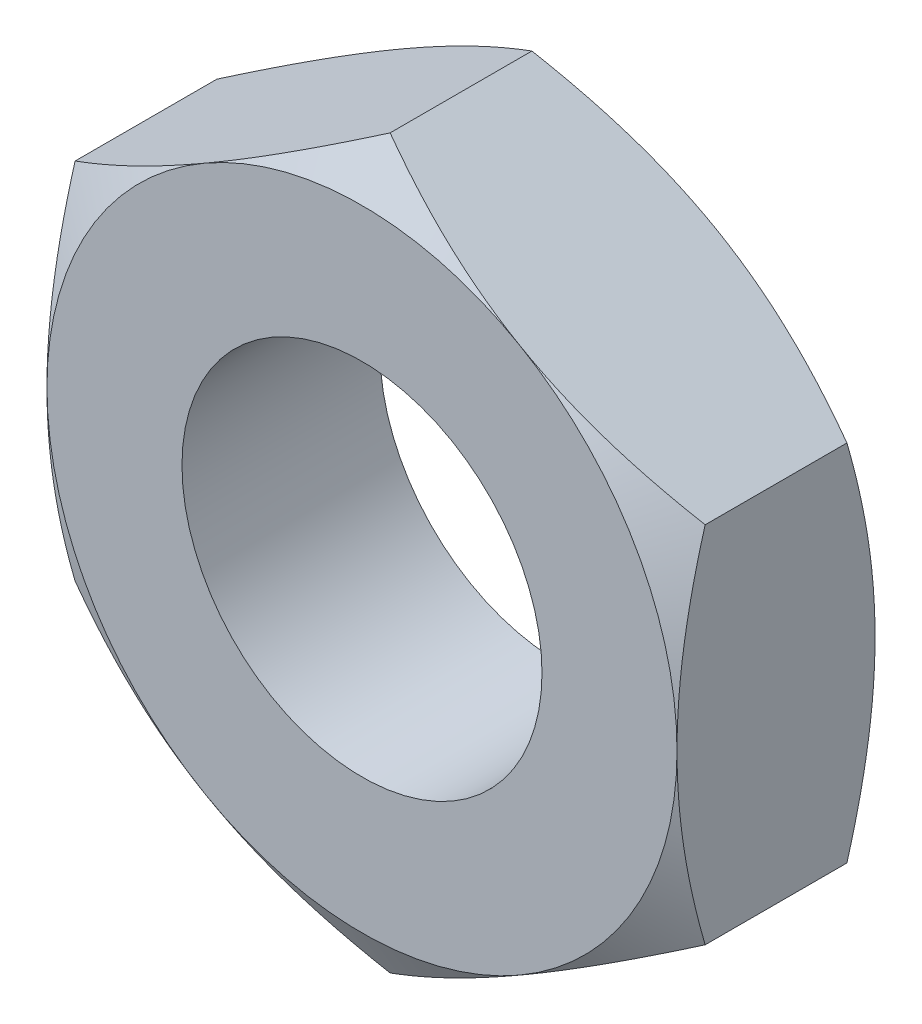
ISO-10303-21;
HEADER;
FILE_DESCRIPTION(('STEP AP214'),'2;1');
FILE_NAME('part.step','',(''),(''),'','','');
FILE_SCHEMA(('AUTOMOTIVE_DESIGN { 1 0 10303 214 1 1 1 1 }'));
ENDSEC;
DATA;
#1=APPLICATION_CONTEXT('core data for automotive mechanical design processes');
#2=APPLICATION_PROTOCOL_DEFINITION('international standard','automotive_design',2000,#1);
#3=PRODUCT_CONTEXT('',#1,'mechanical');
#4=PRODUCT('Part','Part','',(#3));
#5=PRODUCT_RELATED_PRODUCT_CATEGORY('part','',(#4));
#6=PRODUCT_DEFINITION_FORMATION('','',#4);
#7=PRODUCT_DEFINITION_CONTEXT('part definition',#1,'design');
#8=PRODUCT_DEFINITION('design','',#6,#7);
#9=PRODUCT_DEFINITION_SHAPE('','',#8);
#10=(LENGTH_UNIT() NAMED_UNIT(*) SI_UNIT(.MILLI.,.METRE.));
#11=(NAMED_UNIT(*) PLANE_ANGLE_UNIT() SI_UNIT($,.RADIAN.));
#12=(NAMED_UNIT(*) SI_UNIT($,.STERADIAN.) SOLID_ANGLE_UNIT());
#13=UNCERTAINTY_MEASURE_WITH_UNIT(LENGTH_MEASURE(1.E-05),#10,'distance_accuracy_value','');
#14=(GEOMETRIC_REPRESENTATION_CONTEXT(3) GLOBAL_UNCERTAINTY_ASSIGNED_CONTEXT((#13)) GLOBAL_UNIT_ASSIGNED_CONTEXT((#10,
#11,#12)) REPRESENTATION_CONTEXT('',''));
#15=CARTESIAN_POINT('',(0.,0.,0.));
#16=DIRECTION('',(0.,0.,1.));
#17=DIRECTION('',(1.,0.,0.));
#18=AXIS2_PLACEMENT_3D('',#15,#16,#17);
#19=CARTESIAN_POINT('',(3.5,-2.02072594216369,2.2));
#20=DIRECTION('',(-1.,0.,0.));
#21=DIRECTION('',(0.,-1.,0.));
#22=AXIS2_PLACEMENT_3D('',#19,#20,#21);
#23=PLANE('',#22);
#24=CARTESIAN_POINT('',(3.5,-5.46924830003466,1.72817064960977));
#25=CARTESIAN_POINT('',(3.5,-5.3160325339319,1.65368203284161));
#26=CARTESIAN_POINT('',(3.5,-5.16246946761777,1.57989576354144));
#27=CARTESIAN_POINT('',(3.5,-4.85446420827163,1.43412210319563));
#28=CARTESIAN_POINT('',(3.5,-4.70002188497813,1.36213498768279));
#29=CARTESIAN_POINT('',(3.5,-4.38929746018345,1.22000042777458));
#30=CARTESIAN_POINT('',(3.5,-4.23300994428253,1.14986477981532));
#31=CARTESIAN_POINT('',(3.5,-3.91920628647874,1.01240881530144));
#32=CARTESIAN_POINT('',(3.5,-3.76169020182315,0.945088368486654));
#33=CARTESIAN_POINT('',(3.5,-3.43992986743568,0.811830717092529));
#34=CARTESIAN_POINT('',(3.5,-3.27563570301545,0.746013387877366));
#35=CARTESIAN_POINT('',(3.5,-2.94514050214117,0.619260680803184));
#36=CARTESIAN_POINT('',(3.5,-2.7789392562696,0.55832584507309));
#37=CARTESIAN_POINT('',(3.5,-2.44466350046549,0.442907590019832));
#38=CARTESIAN_POINT('',(3.5,-2.2765934237126,0.388411458204929));
#39=CARTESIAN_POINT('',(3.5,-1.93804244355421,0.287592026768664));
#40=CARTESIAN_POINT('',(3.5,-1.76756230447281,0.241266196164791));
#41=CARTESIAN_POINT('',(3.5,-1.42505372862918,0.159233291877059));
#42=CARTESIAN_POINT('',(3.5,-1.25303977115115,0.123466864404243));
#43=CARTESIAN_POINT('',(3.5,-0.906829690133214,0.0645428429456271));
#44=CARTESIAN_POINT('',(3.5,-0.732633786424573,0.0413839890338932));
#45=CARTESIAN_POINT('',(3.5,-0.385221930339845,0.00982402416555703));
#46=CARTESIAN_POINT('',(3.5,-0.212023945606533,0.00123000796357498));
#47=CARTESIAN_POINT('',(3.5,0.134483135220442,-0.000982061038494));
#48=CARTESIAN_POINT('',(3.5,0.30779223262792,0.00540006663312595));
#49=CARTESIAN_POINT('',(3.5,0.600808452449651,0.0283953341508482));
#50=CARTESIAN_POINT('',(3.5,0.720823864600969,0.0413165782556901));
#51=CARTESIAN_POINT('',(3.5,0.959997786268783,0.0735584985751194));
#52=CARTESIAN_POINT('',(3.5,1.07915618177377,0.0928800107168157));
#53=CARTESIAN_POINT('',(3.5,1.43517556933922,0.159431749380929));
#54=CARTESIAN_POINT('',(3.5,1.67045252291874,0.215237755366697));
#55=CARTESIAN_POINT('',(3.5,2.0223028186702,0.312280798498559));
#56=CARTESIAN_POINT('',(3.5,2.14069288058519,0.347308563183211));
#57=CARTESIAN_POINT('',(3.5,2.37632363129615,0.421071086909466));
#58=CARTESIAN_POINT('',(3.5,2.49356431231599,0.459805871011859));
#59=CARTESIAN_POINT('',(3.5,2.72693202144766,0.540355146382419));
#60=CARTESIAN_POINT('',(3.5,2.84305938630442,0.582168670929318));
#61=CARTESIAN_POINT('',(3.5,3.07434746444732,0.668376668121523));
#62=CARTESIAN_POINT('',(3.5,3.189508190491,0.712771106642873));
#63=CARTESIAN_POINT('',(3.5,3.46665383346563,0.822612348916457));
#64=CARTESIAN_POINT('',(3.5,3.62820926065219,0.889140988213676));
#65=CARTESIAN_POINT('',(3.5,3.94989428806168,1.0255706968675));
#66=CARTESIAN_POINT('',(3.5,4.11002378958713,1.09547199755118));
#67=CARTESIAN_POINT('',(3.5,4.42912766847981,1.23795147957417));
#68=CARTESIAN_POINT('',(3.5,4.58810177576508,1.31053026413931));
#69=CARTESIAN_POINT('',(3.5,4.90506153613176,1.45781837889872));
#70=CARTESIAN_POINT('',(3.5,5.06304716611059,1.5325277586639));
#71=CARTESIAN_POINT('',(3.5,5.53614087361735,1.75938858364162));
#72=CARTESIAN_POINT('',(3.5,5.85001764077631,1.91410589374331));
#73=CARTESIAN_POINT('',(3.5,6.47541755316769,2.22809162540922));
#74=CARTESIAN_POINT('',(3.5,6.78694100917245,2.38735943227612));
#75=CARTESIAN_POINT('',(3.5,7.38120615790457,2.69508119469331));
#76=CARTESIAN_POINT('',(3.5,7.66408741921195,2.84326612407885));
#77=CARTESIAN_POINT('',(3.5,8.22880069564564,3.14164545053329));
#78=CARTESIAN_POINT('',(3.5,8.51063266881926,3.29183992686819));
#79=CARTESIAN_POINT('',(3.5,9.07272628611477,3.59335012868182));
#80=CARTESIAN_POINT('',(3.5,9.3529901139039,3.74466178850475));
#81=CARTESIAN_POINT('',(3.5,9.912849860214,4.0484767281834));
#82=CARTESIAN_POINT('',(3.5,10.1924458174643,4.20097993663836));
#83=CARTESIAN_POINT('',(3.5,10.4717977315042,4.35392562294259));
#84=B_SPLINE_CURVE_WITH_KNOTS('',3,(#24,#25,#26,#27,#28,#29,#30,#31,#32,#33,#34,#35,#36,#37,#38,
#39,#40,#41,#42,#43,#44,#45,#46,#47,#48,#49,#50,#51,#52,#53,#54,#55,#56,#57,#58,#59,#60,#61,#62,
#63,#64,#65,#66,#67,#68,#69,#70,#71,#72,#73,#74,#75,#76,#77,#78,#79,#80,#81,#82,#83),
.UNSPECIFIED.,.F.,.F.,(4,2,2,2,2,2,2,2,2,2,2,2,2,2,2,2,2,2,2,2,2,2,2,2,2,2,2,2,2,4),(0.,
0.511095691915975,1.02226918221845,1.53615661638066,2.05002024645588,2.58092205299665,
3.11188272690305,3.64177691176673,4.17150665745021,4.69819951186406,5.22483972205929,
5.74444865949466,6.26406385856815,6.626015949001,6.98801533197522,7.71239857979882,
8.08275565698911,8.45311523810376,8.82335901859984,9.19359790497297,9.71769804639403,
10.2418341865024,10.7660891422144,11.2903563053274,12.3401028193587,13.3897081941522,
14.3477294074532,15.3057885216882,16.2612890207642,17.2167326962569),.UNSPECIFIED.);
#85=CARTESIAN_POINT('',(3.5,2.02072594216369,0.312607391169643));
#86=VERTEX_POINT('',#85);
#87=CARTESIAN_POINT('',(3.5,0.,0.));
#88=VERTEX_POINT('',#87);
#89=EDGE_CURVE('E123',#86,#88,#84,.F.);
#90=ORIENTED_EDGE('',*,*,#89,.F.);
#91=DIRECTION('',(0.,0.,-1.));
#92=VECTOR('',#91,1.);
#93=CARTESIAN_POINT('',(3.5,2.02072594216369,2.2));
#94=LINE('',#93,#92);
#95=CARTESIAN_POINT('',(3.5,2.02072594216369,1.88739260883036));
#96=VERTEX_POINT('',#95);
#97=EDGE_CURVE('E258',#96,#86,#94,.T.);
#98=ORIENTED_EDGE('',*,*,#97,.F.);
#99=CARTESIAN_POINT('',(3.5,-5.46924830003466,0.47182935039024));
#100=CARTESIAN_POINT('',(3.5,-5.3160325339319,0.546317967158399));
#101=CARTESIAN_POINT('',(3.5,-5.16246946761776,0.620104236458562));
#102=CARTESIAN_POINT('',(3.5,-4.85446420827163,0.765877896804374));
#103=CARTESIAN_POINT('',(3.5,-4.70002188497813,0.837865012317215));
#104=CARTESIAN_POINT('',(3.5,-4.38929746018345,0.979999572225422));
#105=CARTESIAN_POINT('',(3.5,-4.23300994428253,1.05013522018468));
#106=CARTESIAN_POINT('',(3.5,-3.91920628647874,1.18759118469857));
#107=CARTESIAN_POINT('',(3.5,-3.76169020182314,1.25491163151335));
#108=CARTESIAN_POINT('',(3.5,-3.43992986743568,1.38816928290748));
#109=CARTESIAN_POINT('',(3.5,-3.27563570301545,1.45398661212264));
#110=CARTESIAN_POINT('',(3.5,-2.94514050214116,1.58073931919682));
#111=CARTESIAN_POINT('',(3.5,-2.7789392562696,1.64167415492691));
#112=CARTESIAN_POINT('',(3.5,-2.44466350046549,1.75709240998017));
#113=CARTESIAN_POINT('',(3.5,-2.2765934237126,1.81158854179507));
#114=CARTESIAN_POINT('',(3.5,-1.93804244355421,1.91240797323134));
#115=CARTESIAN_POINT('',(3.5,-1.7675623044728,1.95873380383521));
#116=CARTESIAN_POINT('',(3.5,-1.42505372862918,2.04076670812294));
#117=CARTESIAN_POINT('',(3.5,-1.25303977115115,2.07653313559576));
#118=CARTESIAN_POINT('',(3.5,-0.906829690133215,2.13545715705437));
#119=CARTESIAN_POINT('',(3.5,-0.732633786424574,2.15861601096611));
#120=CARTESIAN_POINT('',(3.5,-0.385221930339846,2.19017597583444));
#121=CARTESIAN_POINT('',(3.5,-0.212023945606534,2.19876999203643));
#122=CARTESIAN_POINT('',(3.5,0.134483135220441,2.20098206103849));
#123=CARTESIAN_POINT('',(3.5,0.307792232627919,2.19459993336688));
#124=CARTESIAN_POINT('',(3.5,0.600808452449651,2.17160466584915));
#125=CARTESIAN_POINT('',(3.5,0.720823864600968,2.15868342174431));
#126=CARTESIAN_POINT('',(3.5,0.959997786268783,2.12644150142488));
#127=CARTESIAN_POINT('',(3.5,1.07915618177377,2.10711998928319));
#128=CARTESIAN_POINT('',(3.5,1.43517556933922,2.04056825061907));
#129=CARTESIAN_POINT('',(3.5,1.67045252291874,1.9847622446333));
#130=CARTESIAN_POINT('',(3.5,2.02230281867021,1.88771920150144));
#131=CARTESIAN_POINT('',(3.5,2.1406928805852,1.85269143681679));
#132=CARTESIAN_POINT('',(3.5,2.37632363129616,1.77892891309053));
#133=CARTESIAN_POINT('',(3.5,2.49356431231599,1.74019412898814));
#134=CARTESIAN_POINT('',(3.5,2.72693202144767,1.65964485361758));
#135=CARTESIAN_POINT('',(3.5,2.84305938630443,1.61783132907068));
#136=CARTESIAN_POINT('',(3.5,3.07434746444733,1.53162333187848));
#137=CARTESIAN_POINT('',(3.5,3.18950819049101,1.48722889335713));
#138=CARTESIAN_POINT('',(3.5,3.46665383346564,1.37738765108354));
#139=CARTESIAN_POINT('',(3.5,3.6282092606522,1.31085901178632));
#140=CARTESIAN_POINT('',(3.5,3.94989428806169,1.1744293031325));
#141=CARTESIAN_POINT('',(3.5,4.11002378958714,1.10452800244882));
#142=CARTESIAN_POINT('',(3.5,4.42912766847982,0.962048520425834));
#143=CARTESIAN_POINT('',(3.5,4.58810177576509,0.889469735860695));
#144=CARTESIAN_POINT('',(3.5,4.90506153613177,0.74218162110128));
#145=CARTESIAN_POINT('',(3.5,5.0630471661106,0.667472241336096));
#146=CARTESIAN_POINT('',(3.5,5.53614087361736,0.440611416358378));
#147=CARTESIAN_POINT('',(3.5,5.85001764077632,0.285894106256687));
#148=CARTESIAN_POINT('',(3.5,6.47541755316769,-0.0280916254092149));
#149=CARTESIAN_POINT('',(3.5,6.78694100917246,-0.187359432276113));
#150=CARTESIAN_POINT('',(3.5,7.38120615790458,-0.495081194693306));
#151=CARTESIAN_POINT('',(3.5,7.66408741921196,-0.643266124078848));
#152=CARTESIAN_POINT('',(3.5,8.22880069564565,-0.941645450533288));
#153=CARTESIAN_POINT('',(3.5,8.51063266881927,-1.09183992686819));
#154=CARTESIAN_POINT('',(3.5,9.07272628611477,-1.39335012868181));
#155=CARTESIAN_POINT('',(3.5,9.35299011390391,-1.54466178850475));
#156=CARTESIAN_POINT('',(3.5,9.91284986021401,-1.84847672818339));
#157=CARTESIAN_POINT('',(3.5,10.1924458174643,-2.00097993663835));
#158=CARTESIAN_POINT('',(3.5,10.4717977315042,-2.15392562294258));
#159=B_SPLINE_CURVE_WITH_KNOTS('',3,(#99,#100,#101,#102,#103,#104,#105,#106,#107,#108,#109,#110,
#111,#112,#113,#114,#115,#116,#117,#118,#119,#120,#121,#122,#123,#124,#125,#126,#127,#128,#129,
#130,#131,#132,#133,#134,#135,#136,#137,#138,#139,#140,#141,#142,#143,#144,#145,#146,#147,#148,
#149,#150,#151,#152,#153,#154,#155,#156,#157,#158),.UNSPECIFIED.,.F.,.F.,(4,2,2,2,2,2,2,2,2,2,2,
2,2,2,2,2,2,2,2,2,2,2,2,2,2,2,2,2,2,4),(0.,0.511095691915974,1.02226918221845,1.53615661638065,
2.05002024645588,2.58092205299665,3.11188272690305,3.64177691176673,4.17150665745021,
4.69819951186405,5.22483972205928,5.74444865949465,6.26406385856814,6.626015949001,
6.98801533197522,7.71239857979882,8.08275565698911,8.45311523810377,8.82335901859984,
9.19359790497298,9.71769804639404,10.2418341865024,10.7660891422144,11.2903563053274,
12.3401028193587,13.3897081941522,14.3477294074532,15.3057885216882,16.2612890207642,
17.2167326962569),.UNSPECIFIED.);
#160=CARTESIAN_POINT('',(3.5,0.,2.2));
#161=VERTEX_POINT('',#160);
#162=EDGE_CURVE('E232',#161,#96,#159,.T.);
#163=ORIENTED_EDGE('',*,*,#162,.F.);
#164=CARTESIAN_POINT('',(3.5,-2.02072594216369,1.88739260883036));
#165=VERTEX_POINT('',#164);
#166=EDGE_CURVE('E238',#165,#161,#159,.T.);
#167=ORIENTED_EDGE('',*,*,#166,.F.);
#168=DIRECTION('',(0.,0.,-1.));
#169=VECTOR('',#168,1.);
#170=CARTESIAN_POINT('',(3.5,-2.02072594216369,2.2));
#171=LINE('',#170,#169);
#172=CARTESIAN_POINT('',(3.5,-2.02072594216369,0.312607391169644));
#173=VERTEX_POINT('',#172);
#174=EDGE_CURVE('E155',#165,#173,#171,.T.);
#175=ORIENTED_EDGE('',*,*,#174,.T.);
#176=EDGE_CURVE('E136',#88,#173,#84,.F.);
#177=ORIENTED_EDGE('',*,*,#176,.F.);
#178=EDGE_LOOP('',(#90,#98,#163,#167,#175,#177));
#179=FACE_BOUND('',#178,.T.);
#180=ADVANCED_FACE('F34',(#179),#23,.F.);
#181=CARTESIAN_POINT('',(3.5,2.02072594216369,2.2));
#182=DIRECTION('',(-0.5,-0.866025403784438,0.));
#183=DIRECTION('',(0.866025403784439,-0.5,0.));
#184=AXIS2_PLACEMENT_3D('',#181,#182,#183);
#185=PLANE('',#184);
#186=CARTESIAN_POINT('',(-0.000199999999999365,4.04156735438122,0.312674060693372));
#187=CARTESIAN_POINT('',(0.15360717845245,3.9527667384984,0.261385788989984));
#188=CARTESIAN_POINT('',(0.308742010834424,3.86319960126198,0.214740953816198));
#189=CARTESIAN_POINT('',(0.621698006576782,3.68251437287562,0.13332187553335));
#190=CARTESIAN_POINT('',(0.779524730787497,3.59139307116725,0.0985764355845627));
#191=CARTESIAN_POINT('',(1.09322221038013,3.41027974688034,0.0444900271828374));
#192=CARTESIAN_POINT('',(1.24904469916069,3.32031559103708,0.0247890862603829));
#193=CARTESIAN_POINT('',(1.56142288720537,3.13996396008051,0.00127013273725575));
#194=CARTESIAN_POINT('',(1.71797745103423,3.04957714051106,-0.00256735545443338));
#195=CARTESIAN_POINT('',(2.01050921992099,2.88068384499777,0.00541530187697905));
#196=CARTESIAN_POINT('',(2.14653021245791,2.80215208834114,0.0152754340696085));
#197=CARTESIAN_POINT('',(2.417686020289,2.64560020969753,0.0465264668994048));
#198=CARTESIAN_POINT('',(2.55281989768468,2.5675806292065,0.0679280432857993));
#199=CARTESIAN_POINT('',(2.82453479240518,2.41070596159678,0.121430407880578));
#200=CARTESIAN_POINT('',(2.96108141927834,2.33187072981463,0.153757994445088));
#201=CARTESIAN_POINT('',(3.2321380929445,2.17537608630783,0.227128933807995));
#202=CARTESIAN_POINT('',(3.36665161246854,2.09771466960098,0.268155046569867));
#203=CARTESIAN_POINT('',(3.5002,2.02061047210985,0.312674060693371));
#204=B_SPLINE_CURVE_WITH_KNOTS('',3,(#186,#187,#188,#189,#190,#191,#192,#193,#194,#195,#196,
#197,#198,#199,#200,#201,#202,#203),.UNSPECIFIED.,.F.,.F.,(4,2,2,2,2,2,2,2,4),(0.,
0.554793832886253,1.11092123814984,1.65328467083219,2.19498204478403,2.6666513085086,
3.13875761298267,3.6213361260051,4.10296698719187),.UNSPECIFIED.);
#205=CARTESIAN_POINT('',(0.,4.04145188432738,0.312607391169644));
#206=VERTEX_POINT('',#205);
#207=CARTESIAN_POINT('',(1.75,3.03108891324553,0.));
#208=VERTEX_POINT('',#207);
#209=EDGE_CURVE('E49',#206,#208,#204,.T.);
#210=ORIENTED_EDGE('',*,*,#209,.F.);
#211=DIRECTION('',(0.,0.,-1.));
#212=VECTOR('',#211,1.);
#213=CARTESIAN_POINT('',(0.,4.04145188432738,2.2));
#214=LINE('',#213,#212);
#215=CARTESIAN_POINT('',(0.,4.04145188432738,1.88739260883036));
#216=VERTEX_POINT('',#215);
#217=EDGE_CURVE('E255',#216,#206,#214,.T.);
#218=ORIENTED_EDGE('',*,*,#217,.F.);
#219=CARTESIAN_POINT('',(3.5002,2.02061047210985,1.88732593930663));
#220=CARTESIAN_POINT('',(3.34639282154755,2.10941108799267,1.93861421101002));
#221=CARTESIAN_POINT('',(3.19125798916558,2.19897822522909,1.9852590461838));
#222=CARTESIAN_POINT('',(2.87830199342322,2.37966345361545,2.06667812446665));
#223=CARTESIAN_POINT('',(2.7204752692125,2.47078475532382,2.10142356441544));
#224=CARTESIAN_POINT('',(2.40677778961987,2.65189807961073,2.15550997281716));
#225=CARTESIAN_POINT('',(2.25095530083931,2.74186223545399,2.17521091373962));
#226=CARTESIAN_POINT('',(1.93857711279463,2.92221386641056,2.19872986726274));
#227=CARTESIAN_POINT('',(1.78202254896577,3.01260068598001,2.20256735545443));
#228=CARTESIAN_POINT('',(1.48949078007901,3.1814939814933,2.19458469812302));
#229=CARTESIAN_POINT('',(1.3534697875421,3.26002573814993,2.18472456593039));
#230=CARTESIAN_POINT('',(1.08231397971101,3.41657761679354,2.1534735331006));
#231=CARTESIAN_POINT('',(0.947180102315318,3.49459719728458,2.1320719567142));
#232=CARTESIAN_POINT('',(0.675465207594817,3.65147186489429,2.07856959211942));
#233=CARTESIAN_POINT('',(0.538918580721665,3.73030709667644,2.04624200555491));
#234=CARTESIAN_POINT('',(0.267861907055499,3.88680174018324,1.97287106619201));
#235=CARTESIAN_POINT('',(0.133348387531464,3.96446315689009,1.93184495343013));
#236=CARTESIAN_POINT('',(-0.00019999999999932,4.04156735438122,1.88732593930663));
#237=B_SPLINE_CURVE_WITH_KNOTS('',3,(#219,#220,#221,#222,#223,#224,#225,#226,#227,#228,#229,
#230,#231,#232,#233,#234,#235,#236),.UNSPECIFIED.,.F.,.F.,(4,2,2,2,2,2,2,2,4),(0.,
0.554793832886253,1.11092123814984,1.65328467083219,2.19498204478403,2.6666513085086,
3.13875761298267,3.6213361260051,4.10296698719187),.UNSPECIFIED.);
#238=CARTESIAN_POINT('',(1.75,3.03108891324554,2.2));
#239=VERTEX_POINT('',#238);
#240=EDGE_CURVE('E217',#239,#216,#237,.T.);
#241=ORIENTED_EDGE('',*,*,#240,.F.);
#242=EDGE_CURVE('E224',#96,#239,#237,.T.);
#243=ORIENTED_EDGE('',*,*,#242,.F.);
#244=ORIENTED_EDGE('',*,*,#97,.T.);
#245=EDGE_CURVE('E130',#208,#86,#204,.T.);
#246=ORIENTED_EDGE('',*,*,#245,.F.);
#247=EDGE_LOOP('',(#210,#218,#241,#243,#244,#246));
#248=FACE_BOUND('',#247,.T.);
#249=ADVANCED_FACE('F209',(#248),#185,.F.);
#250=CARTESIAN_POINT('',(0.,4.04145188432738,2.2));
#251=DIRECTION('',(0.5,-0.866025403784439,0.));
#252=DIRECTION('',(0.866025403784439,0.5,0.));
#253=AXIS2_PLACEMENT_3D('',#250,#251,#252);
#254=PLANE('',#253);
#255=CARTESIAN_POINT('',(-3.5002,2.02061047210985,0.312674060693371));
#256=CARTESIAN_POINT('',(-3.34639282154755,2.10941108799267,0.261385788989984));
#257=CARTESIAN_POINT('',(-3.19125798916557,2.19897822522909,0.214740953816198));
#258=CARTESIAN_POINT('',(-2.87830199342322,2.37966345361545,0.133321875533349));
#259=CARTESIAN_POINT('',(-2.7204752692125,2.47078475532382,0.098576435584562));
#260=CARTESIAN_POINT('',(-2.40677778961987,2.65189807961074,0.044490027182837));
#261=CARTESIAN_POINT('',(-2.25095530083931,2.74186223545399,0.0247890862603827));
#262=CARTESIAN_POINT('',(-1.93857711279462,2.92221386641056,0.00127013273725582));
#263=CARTESIAN_POINT('',(-1.78202254896577,3.01260068598001,-0.00256735545443331));
#264=CARTESIAN_POINT('',(-1.48949078007901,3.1814939814933,0.00541530187697922));
#265=CARTESIAN_POINT('',(-1.35346978754209,3.26002573814993,0.0152754340696087));
#266=CARTESIAN_POINT('',(-1.082313979711,3.41657761679354,0.0465264668994051));
#267=CARTESIAN_POINT('',(-0.947180102315316,3.49459719728458,0.0679280432857997));
#268=CARTESIAN_POINT('',(-0.675465207594815,3.65147186489429,0.121430407880578));
#269=CARTESIAN_POINT('',(-0.538918580721663,3.73030709667644,0.153757994445088));
#270=CARTESIAN_POINT('',(-0.267861907055498,3.88680174018324,0.227128933807995));
#271=CARTESIAN_POINT('',(-0.133348387531463,3.96446315689009,0.268155046569868));
#272=CARTESIAN_POINT('',(0.000200000000000657,4.04156735438122,0.312674060693372));
#273=B_SPLINE_CURVE_WITH_KNOTS('',3,(#255,#256,#257,#258,#259,#260,#261,#262,#263,#264,#265,
#266,#267,#268,#269,#270,#271,#272),.UNSPECIFIED.,.F.,.F.,(4,2,2,2,2,2,2,2,4),(0.,
0.554793832886254,1.11092123814984,1.65328467083219,2.19498204478403,2.6666513085086,
3.13875761298267,3.62133612600509,4.10296698719187),.UNSPECIFIED.);
#274=CARTESIAN_POINT('',(-3.5,2.02072594216369,0.312607391169643));
#275=VERTEX_POINT('',#274);
#276=CARTESIAN_POINT('',(-1.75,3.03108891324553,0.));
#277=VERTEX_POINT('',#276);
#278=EDGE_CURVE('E57',#275,#277,#273,.T.);
#279=ORIENTED_EDGE('',*,*,#278,.F.);
#280=DIRECTION('',(0.,0.,-1.));
#281=VECTOR('',#280,1.);
#282=CARTESIAN_POINT('',(-3.5,2.02072594216369,2.2));
#283=LINE('',#282,#281);
#284=CARTESIAN_POINT('',(-3.5,2.02072594216369,1.88739260883036));
#285=VERTEX_POINT('',#284);
#286=EDGE_CURVE('E252',#285,#275,#283,.T.);
#287=ORIENTED_EDGE('',*,*,#286,.F.);
#288=CARTESIAN_POINT('',(0.000200000000000554,4.04156735438122,1.88732593930663));
#289=CARTESIAN_POINT('',(-0.153607178452449,3.9527667384984,1.93861421101002));
#290=CARTESIAN_POINT('',(-0.308742010834424,3.86319960126198,1.9852590461838));
#291=CARTESIAN_POINT('',(-0.621698006576781,3.68251437287562,2.06667812446665));
#292=CARTESIAN_POINT('',(-0.779524730787495,3.59139307116725,2.10142356441544));
#293=CARTESIAN_POINT('',(-1.09322221038013,3.41027974688034,2.15550997281716));
#294=CARTESIAN_POINT('',(-1.24904469916069,3.32031559103708,2.17521091373962));
#295=CARTESIAN_POINT('',(-1.56142288720537,3.13996396008052,2.19872986726274));
#296=CARTESIAN_POINT('',(-1.71797745103423,3.04957714051106,2.20256735545443));
#297=CARTESIAN_POINT('',(-2.01050921992099,2.88068384499777,2.19458469812302));
#298=CARTESIAN_POINT('',(-2.14653021245791,2.80215208834115,2.18472456593039));
#299=CARTESIAN_POINT('',(-2.41768602028899,2.64560020969754,2.1534735331006));
#300=CARTESIAN_POINT('',(-2.55281989768468,2.5675806292065,2.1320719567142));
#301=CARTESIAN_POINT('',(-2.82453479240518,2.41070596159678,2.07856959211942));
#302=CARTESIAN_POINT('',(-2.96108141927833,2.33187072981464,2.04624200555491));
#303=CARTESIAN_POINT('',(-3.2321380929445,2.17537608630783,1.97287106619201));
#304=CARTESIAN_POINT('',(-3.36665161246854,2.09771466960099,1.93184495343013));
#305=CARTESIAN_POINT('',(-3.5002,2.02061047210985,1.88732593930663));
#306=B_SPLINE_CURVE_WITH_KNOTS('',3,(#288,#289,#290,#291,#292,#293,#294,#295,#296,#297,#298,
#299,#300,#301,#302,#303,#304,#305),.UNSPECIFIED.,.F.,.F.,(4,2,2,2,2,2,2,2,4),(0.,
0.554793832886254,1.11092123814984,1.65328467083218,2.19498204478403,2.6666513085086,
3.13875761298267,3.62133612600509,4.10296698719187),.UNSPECIFIED.);
#307=CARTESIAN_POINT('',(-1.75,3.03108891324554,2.2));
#308=VERTEX_POINT('',#307);
#309=EDGE_CURVE('E226',#308,#285,#306,.T.);
#310=ORIENTED_EDGE('',*,*,#309,.F.);
#311=EDGE_CURVE('E225',#216,#308,#306,.T.);
#312=ORIENTED_EDGE('',*,*,#311,.F.);
#313=ORIENTED_EDGE('',*,*,#217,.T.);
#314=EDGE_CURVE('E202',#277,#206,#273,.T.);
#315=ORIENTED_EDGE('',*,*,#314,.F.);
#316=EDGE_LOOP('',(#279,#287,#310,#312,#313,#315));
#317=FACE_BOUND('',#316,.T.);
#318=ADVANCED_FACE('F212',(#317),#254,.F.);
#319=CARTESIAN_POINT('',(-3.5,2.02072594216369,2.2));
#320=DIRECTION('',(1.,0.,0.));
#321=DIRECTION('',(0.,1.,0.));
#322=AXIS2_PLACEMENT_3D('',#319,#320,#321);
#323=PLANE('',#322);
#324=CARTESIAN_POINT('',(-3.5,-5.46924830003466,1.72817064960976));
#325=CARTESIAN_POINT('',(-3.5,-5.31603253393189,1.6536820328416));
#326=CARTESIAN_POINT('',(-3.5,-5.16246946761776,1.57989576354144));
#327=CARTESIAN_POINT('',(-3.5,-4.85446420827163,1.43412210319563));
#328=CARTESIAN_POINT('',(-3.5,-4.70002188497813,1.36213498768279));
#329=CARTESIAN_POINT('',(-3.5,-4.38929746018345,1.22000042777458));
#330=CARTESIAN_POINT('',(-3.5,-4.23300994428253,1.14986477981532));
#331=CARTESIAN_POINT('',(-3.5,-3.91920628647874,1.01240881530144));
#332=CARTESIAN_POINT('',(-3.5,-3.76169020182314,0.945088368486653));
#333=CARTESIAN_POINT('',(-3.5,-3.43992986743568,0.811830717092527));
#334=CARTESIAN_POINT('',(-3.5,-3.27563570301545,0.746013387877364));
#335=CARTESIAN_POINT('',(-3.5,-2.94514050214116,0.619260680803182));
#336=CARTESIAN_POINT('',(-3.5,-2.77893925626959,0.558325845073088));
#337=CARTESIAN_POINT('',(-3.5,-2.44466350046549,0.44290759001983));
#338=CARTESIAN_POINT('',(-3.5,-2.2765934237126,0.388411458204928));
#339=CARTESIAN_POINT('',(-3.5,-1.93804244355421,0.287592026768663));
#340=CARTESIAN_POINT('',(-3.5,-1.7675623044728,0.24126619616479));
#341=CARTESIAN_POINT('',(-3.5,-1.42505372862918,0.159233291877058));
#342=CARTESIAN_POINT('',(-3.5,-1.25303977115114,0.123466864404242));
#343=CARTESIAN_POINT('',(-3.5,-0.906829690133213,0.064542842945626));
#344=CARTESIAN_POINT('',(-3.5,-0.732633786424572,0.0413839890338921));
#345=CARTESIAN_POINT('',(-3.5,-0.385221930339844,0.00982402416555599));
#346=CARTESIAN_POINT('',(-3.5,-0.212023945606533,0.00123000796357397));
#347=CARTESIAN_POINT('',(-3.5,0.134483135220442,-0.000982061038495184));
#348=CARTESIAN_POINT('',(-3.5,0.30779223262792,0.00540006663312456));
#349=CARTESIAN_POINT('',(-3.5,0.600808452449652,0.028395334150847));
#350=CARTESIAN_POINT('',(-3.5,0.720823864600968,0.041316578255689));
#351=CARTESIAN_POINT('',(-3.5,0.959997786268783,0.0735584985751185));
#352=CARTESIAN_POINT('',(-3.5,1.07915618177377,0.0928800107168148));
#353=CARTESIAN_POINT('',(-3.5,1.43517556933922,0.159431749380928));
#354=CARTESIAN_POINT('',(-3.5,1.67045252291874,0.215237755366697));
#355=CARTESIAN_POINT('',(-3.5,2.0223028186702,0.312280798498559));
#356=CARTESIAN_POINT('',(-3.5,2.14069288058519,0.34730856318321));
#357=CARTESIAN_POINT('',(-3.5,2.37632363129615,0.421071086909465));
#358=CARTESIAN_POINT('',(-3.5,2.49356431231599,0.459805871011858));
#359=CARTESIAN_POINT('',(-3.5,2.72693202144766,0.540355146382417));
#360=CARTESIAN_POINT('',(-3.5,2.84305938630442,0.582168670929317));
#361=CARTESIAN_POINT('',(-3.5,3.07434746444732,0.668376668121522));
#362=CARTESIAN_POINT('',(-3.5,3.189508190491,0.712771106642872));
#363=CARTESIAN_POINT('',(-3.5,3.46665383346563,0.822612348916457));
#364=CARTESIAN_POINT('',(-3.5,3.62820926065219,0.889140988213675));
#365=CARTESIAN_POINT('',(-3.5,3.94989428806168,1.0255706968675));
#366=CARTESIAN_POINT('',(-3.5,4.11002378958713,1.09547199755118));
#367=CARTESIAN_POINT('',(-3.5,4.42912766847981,1.23795147957417));
#368=CARTESIAN_POINT('',(-3.5,4.58810177576508,1.31053026413931));
#369=CARTESIAN_POINT('',(-3.5,4.90506153613176,1.45781837889872));
#370=CARTESIAN_POINT('',(-3.5,5.06304716611059,1.5325277586639));
#371=CARTESIAN_POINT('',(-3.5,5.53614087361735,1.75938858364162));
#372=CARTESIAN_POINT('',(-3.5,5.85001764077631,1.91410589374331));
#373=CARTESIAN_POINT('',(-3.5,6.47541755316768,2.22809162540922));
#374=CARTESIAN_POINT('',(-3.5,6.78694100917245,2.38735943227612));
#375=CARTESIAN_POINT('',(-3.5,7.38120615790457,2.69508119469331));
#376=CARTESIAN_POINT('',(-3.5,7.66408741921195,2.84326612407885));
#377=CARTESIAN_POINT('',(-3.5,8.22880069564564,3.14164545053329));
#378=CARTESIAN_POINT('',(-3.5,8.51063266881926,3.29183992686819));
#379=CARTESIAN_POINT('',(-3.5,9.07272628611477,3.59335012868182));
#380=CARTESIAN_POINT('',(-3.5,9.3529901139039,3.74466178850475));
#381=CARTESIAN_POINT('',(-3.5,9.912849860214,4.0484767281834));
#382=CARTESIAN_POINT('',(-3.5,10.1924458174643,4.20097993663836));
#383=CARTESIAN_POINT('',(-3.5,10.4717977315042,4.35392562294259));
#384=B_SPLINE_CURVE_WITH_KNOTS('',3,(#324,#325,#326,#327,#328,#329,#330,#331,#332,#333,#334,
#335,#336,#337,#338,#339,#340,#341,#342,#343,#344,#345,#346,#347,#348,#349,#350,#351,#352,#353,
#354,#355,#356,#357,#358,#359,#360,#361,#362,#363,#364,#365,#366,#367,#368,#369,#370,#371,#372,
#373,#374,#375,#376,#377,#378,#379,#380,#381,#382,#383),.UNSPECIFIED.,.F.,.F.,(4,2,2,2,2,2,2,2,
2,2,2,2,2,2,2,2,2,2,2,2,2,2,2,2,2,2,2,2,2,4),(0.,0.511095691915975,1.02226918221845,
1.53615661638065,2.05002024645587,2.58092205299665,3.11188272690305,3.64177691176673,
4.17150665745021,4.69819951186405,5.22483972205928,5.74444865949465,6.26406385856814,
6.62601594900099,6.98801533197522,7.71239857979881,8.0827556569891,8.45311523810376,
8.82335901859983,9.19359790497297,9.71769804639402,10.2418341865024,10.7660891422144,
11.2903563053274,12.3401028193587,13.3897081941522,14.3477294074532,15.3057885216882,
16.2612890207642,17.2167326962569),.UNSPECIFIED.);
#385=CARTESIAN_POINT('',(-3.5,-2.02072594216369,0.312607391169642));
#386=VERTEX_POINT('',#385);
#387=CARTESIAN_POINT('',(-3.5,0.,0.));
#388=VERTEX_POINT('',#387);
#389=EDGE_CURVE('E170',#386,#388,#384,.T.);
#390=ORIENTED_EDGE('',*,*,#389,.F.);
#391=DIRECTION('',(0.,0.,-1.));
#392=VECTOR('',#391,1.);
#393=CARTESIAN_POINT('',(-3.5,-2.02072594216369,2.2));
#394=LINE('',#393,#392);
#395=CARTESIAN_POINT('',(-3.5,-2.02072594216369,1.88739260883036));
#396=VERTEX_POINT('',#395);
#397=EDGE_CURVE('E249',#396,#386,#394,.T.);
#398=ORIENTED_EDGE('',*,*,#397,.F.);
#399=CARTESIAN_POINT('',(-3.5,-5.46924830003465,0.471829350390243));
#400=CARTESIAN_POINT('',(-3.5,-5.31603253393189,0.546317967158402));
#401=CARTESIAN_POINT('',(-3.5,-5.16246946761776,0.620104236458565));
#402=CARTESIAN_POINT('',(-3.5,-4.85446420827162,0.765877896804377));
#403=CARTESIAN_POINT('',(-3.5,-4.70002188497813,0.837865012317218));
#404=CARTESIAN_POINT('',(-3.5,-4.38929746018345,0.979999572225424));
#405=CARTESIAN_POINT('',(-3.5,-4.23300994428253,1.05013522018468));
#406=CARTESIAN_POINT('',(-3.5,-3.91920628647874,1.18759118469857));
#407=CARTESIAN_POINT('',(-3.5,-3.76169020182314,1.25491163151335));
#408=CARTESIAN_POINT('',(-3.5,-3.43992986743567,1.38816928290748));
#409=CARTESIAN_POINT('',(-3.5,-3.27563570301545,1.45398661212264));
#410=CARTESIAN_POINT('',(-3.5,-2.94514050214116,1.58073931919682));
#411=CARTESIAN_POINT('',(-3.5,-2.77893925626959,1.64167415492692));
#412=CARTESIAN_POINT('',(-3.5,-2.44466350046548,1.75709240998017));
#413=CARTESIAN_POINT('',(-3.5,-2.27659342371259,1.81158854179508));
#414=CARTESIAN_POINT('',(-3.5,-1.9380424435542,1.91240797323134));
#415=CARTESIAN_POINT('',(-3.5,-1.7675623044728,1.95873380383521));
#416=CARTESIAN_POINT('',(-3.5,-1.42505372862918,2.04076670812294));
#417=CARTESIAN_POINT('',(-3.5,-1.25303977115114,2.07653313559576));
#418=CARTESIAN_POINT('',(-3.5,-0.906829690133213,2.13545715705437));
#419=CARTESIAN_POINT('',(-3.5,-0.732633786424572,2.15861601096611));
#420=CARTESIAN_POINT('',(-3.5,-0.385221930339845,2.19017597583444));
#421=CARTESIAN_POINT('',(-3.5,-0.212023945606533,2.19876999203643));
#422=CARTESIAN_POINT('',(-3.5,0.134483135220442,2.2009820610385));
#423=CARTESIAN_POINT('',(-3.5,0.30779223262792,2.19459993336688));
#424=CARTESIAN_POINT('',(-3.5,0.600808452449651,2.17160466584915));
#425=CARTESIAN_POINT('',(-3.5,0.720823864600969,2.15868342174431));
#426=CARTESIAN_POINT('',(-3.5,0.959997786268784,2.12644150142488));
#427=CARTESIAN_POINT('',(-3.5,1.07915618177377,2.10711998928319));
#428=CARTESIAN_POINT('',(-3.5,1.43517556933922,2.04056825061907));
#429=CARTESIAN_POINT('',(-3.5,1.67045252291874,1.9847622446333));
#430=CARTESIAN_POINT('',(-3.5,2.02230281867021,1.88771920150144));
#431=CARTESIAN_POINT('',(-3.5,2.1406928805852,1.85269143681679));
#432=CARTESIAN_POINT('',(-3.5,2.37632363129616,1.77892891309053));
#433=CARTESIAN_POINT('',(-3.5,2.49356431231599,1.74019412898814));
#434=CARTESIAN_POINT('',(-3.5,2.72693202144767,1.65964485361758));
#435=CARTESIAN_POINT('',(-3.5,2.84305938630443,1.61783132907068));
#436=CARTESIAN_POINT('',(-3.5,3.07434746444733,1.53162333187848));
#437=CARTESIAN_POINT('',(-3.5,3.18950819049101,1.48722889335713));
#438=CARTESIAN_POINT('',(-3.5,3.46665383346564,1.37738765108354));
#439=CARTESIAN_POINT('',(-3.5,3.6282092606522,1.31085901178632));
#440=CARTESIAN_POINT('',(-3.5,3.94989428806169,1.1744293031325));
#441=CARTESIAN_POINT('',(-3.5,4.11002378958714,1.10452800244882));
#442=CARTESIAN_POINT('',(-3.5,4.42912766847982,0.962048520425834));
#443=CARTESIAN_POINT('',(-3.5,4.58810177576509,0.889469735860695));
#444=CARTESIAN_POINT('',(-3.5,4.90506153613177,0.74218162110128));
#445=CARTESIAN_POINT('',(-3.5,5.0630471661106,0.667472241336097));
#446=CARTESIAN_POINT('',(-3.5,5.53614087361736,0.44061141635838));
#447=CARTESIAN_POINT('',(-3.5,5.85001764077632,0.285894106256689));
#448=CARTESIAN_POINT('',(-3.5,6.47541755316769,-0.0280916254092138));
#449=CARTESIAN_POINT('',(-3.5,6.78694100917246,-0.187359432276112));
#450=CARTESIAN_POINT('',(-3.5,7.38120615790458,-0.495081194693305));
#451=CARTESIAN_POINT('',(-3.5,7.66408741921196,-0.643266124078847));
#452=CARTESIAN_POINT('',(-3.5,8.22880069564565,-0.941645450533287));
#453=CARTESIAN_POINT('',(-3.5,8.51063266881927,-1.09183992686819));
#454=CARTESIAN_POINT('',(-3.5,9.07272628611477,-1.39335012868181));
#455=CARTESIAN_POINT('',(-3.5,9.35299011390391,-1.54466178850474));
#456=CARTESIAN_POINT('',(-3.5,9.912849860214,-1.84847672818339));
#457=CARTESIAN_POINT('',(-3.5,10.1924458174643,-2.00097993663835));
#458=CARTESIAN_POINT('',(-3.5,10.4717977315042,-2.15392562294259));
#459=B_SPLINE_CURVE_WITH_KNOTS('',3,(#399,#400,#401,#402,#403,#404,#405,#406,#407,#408,#409,
#410,#411,#412,#413,#414,#415,#416,#417,#418,#419,#420,#421,#422,#423,#424,#425,#426,#427,#428,
#429,#430,#431,#432,#433,#434,#435,#436,#437,#438,#439,#440,#441,#442,#443,#444,#445,#446,#447,
#448,#449,#450,#451,#452,#453,#454,#455,#456,#457,#458),.UNSPECIFIED.,.F.,.F.,(4,2,2,2,2,2,2,2,
2,2,2,2,2,2,2,2,2,2,2,2,2,2,2,2,2,2,2,2,2,4),(0.,0.511095691915974,1.02226918221845,
1.53615661638065,2.05002024645587,2.58092205299665,3.11188272690305,3.64177691176673,
4.17150665745021,4.69819951186405,5.22483972205928,5.74444865949465,6.26406385856814,
6.62601594900099,6.98801533197521,7.71239857979882,8.0827556569891,8.45311523810376,
8.82335901859984,9.19359790497298,9.71769804639403,10.2418341865024,10.7660891422144,
11.2903563053274,12.3401028193587,13.3897081941522,14.3477294074532,15.3057885216882,
16.2612890207642,17.2167326962569),.UNSPECIFIED.);
#460=CARTESIAN_POINT('',(-3.5,0.,2.2));
#461=VERTEX_POINT('',#460);
#462=EDGE_CURVE('E286',#461,#396,#459,.F.);
#463=ORIENTED_EDGE('',*,*,#462,.F.);
#464=EDGE_CURVE('E291',#285,#461,#459,.F.);
#465=ORIENTED_EDGE('',*,*,#464,.F.);
#466=ORIENTED_EDGE('',*,*,#286,.T.);
#467=EDGE_CURVE('E342',#388,#275,#384,.T.);
#468=ORIENTED_EDGE('',*,*,#467,.F.);
#469=EDGE_LOOP('',(#390,#398,#463,#465,#466,#468));
#470=FACE_BOUND('',#469,.T.);
#471=ADVANCED_FACE('F274',(#470),#323,.F.);
#472=CARTESIAN_POINT('',(-3.5,-2.02072594216369,2.2));
#473=DIRECTION('',(0.5,0.866025403784439,0.));
#474=DIRECTION('',(-0.866025403784439,0.5,0.));
#475=AXIS2_PLACEMENT_3D('',#472,#473,#474);
#476=PLANE('',#475);
#477=CARTESIAN_POINT('',(0.00020000000000269,-4.04156735438122,0.312674060693371));
#478=CARTESIAN_POINT('',(-0.153607178452447,-3.9527667384984,0.261385788989984));
#479=CARTESIAN_POINT('',(-0.308742010834421,-3.86319960126198,0.214740953816197));
#480=CARTESIAN_POINT('',(-0.621698006576779,-3.68251437287562,0.133321875533349));
#481=CARTESIAN_POINT('',(-0.779524730787494,-3.59139307116725,0.0985764355845619));
#482=CARTESIAN_POINT('',(-1.09322221038012,-3.41027974688034,0.0444900271828366));
#483=CARTESIAN_POINT('',(-1.24904469916069,-3.32031559103708,0.0247890862603819));
#484=CARTESIAN_POINT('',(-1.56142288720537,-3.13996396008051,0.00127013273725455));
#485=CARTESIAN_POINT('',(-1.71797745103423,-3.04957714051106,-0.00256735545443466));
#486=CARTESIAN_POINT('',(-2.01050921992099,-2.88068384499777,0.00541530187697772));
#487=CARTESIAN_POINT('',(-2.1465302124579,-2.80215208834114,0.0152754340696072));
#488=CARTESIAN_POINT('',(-2.41768602028899,-2.64560020969753,0.0465264668994035));
#489=CARTESIAN_POINT('',(-2.55281989768468,-2.5675806292065,0.0679280432857981));
#490=CARTESIAN_POINT('',(-2.82453479240518,-2.41070596159678,0.121430407880577));
#491=CARTESIAN_POINT('',(-2.96108141927833,-2.33187072981463,0.153757994445087));
#492=CARTESIAN_POINT('',(-3.2321380929445,-2.17537608630783,0.227128933807994));
#493=CARTESIAN_POINT('',(-3.36665161246853,-2.09771466960098,0.268155046569866));
#494=CARTESIAN_POINT('',(-3.5002,-2.02061047210985,0.31267406069337));
#495=B_SPLINE_CURVE_WITH_KNOTS('',3,(#477,#478,#479,#480,#481,#482,#483,#484,#485,#486,#487,
#488,#489,#490,#491,#492,#493,#494),.UNSPECIFIED.,.F.,.F.,(4,2,2,2,2,2,2,2,4),(0.,
0.554793832886254,1.11092123814984,1.65328467083219,2.19498204478403,2.6666513085086,
3.13875761298267,3.6213361260051,4.10296698719187),.UNSPECIFIED.);
#496=CARTESIAN_POINT('',(0.,-4.04145188432738,0.312607391169643));
#497=VERTEX_POINT('',#496);
#498=CARTESIAN_POINT('',(-1.75,-3.03108891324553,0.));
#499=VERTEX_POINT('',#498);
#500=EDGE_CURVE('E156',#497,#499,#495,.T.);
#501=ORIENTED_EDGE('',*,*,#500,.F.);
#502=DIRECTION('',(0.,0.,-1.));
#503=VECTOR('',#502,1.);
#504=CARTESIAN_POINT('',(0.,-4.04145188432738,2.2));
#505=LINE('',#504,#503);
#506=CARTESIAN_POINT('',(0.,-4.04145188432738,1.88739260883036));
#507=VERTEX_POINT('',#506);
#508=EDGE_CURVE('E246',#507,#497,#505,.T.);
#509=ORIENTED_EDGE('',*,*,#508,.F.);
#510=CARTESIAN_POINT('',(-3.5002,-2.02061047210985,1.88732593930663));
#511=CARTESIAN_POINT('',(-3.34639282154755,-2.10941108799267,1.93861421101002));
#512=CARTESIAN_POINT('',(-3.19125798916557,-2.19897822522909,1.98525904618381));
#513=CARTESIAN_POINT('',(-2.87830199342322,-2.37966345361545,2.06667812446665));
#514=CARTESIAN_POINT('',(-2.7204752692125,-2.47078475532382,2.10142356441544));
#515=CARTESIAN_POINT('',(-2.40677778961987,-2.65189807961073,2.15550997281716));
#516=CARTESIAN_POINT('',(-2.25095530083931,-2.74186223545399,2.17521091373962));
#517=CARTESIAN_POINT('',(-1.93857711279463,-2.92221386641055,2.19872986726275));
#518=CARTESIAN_POINT('',(-1.78202254896577,-3.01260068598001,2.20256735545443));
#519=CARTESIAN_POINT('',(-1.48949078007901,-3.1814939814933,2.19458469812302));
#520=CARTESIAN_POINT('',(-1.35346978754209,-3.26002573814993,2.18472456593039));
#521=CARTESIAN_POINT('',(-1.082313979711,-3.41657761679354,2.1534735331006));
#522=CARTESIAN_POINT('',(-0.947180102315316,-3.49459719728457,2.1320719567142));
#523=CARTESIAN_POINT('',(-0.675465207594814,-3.65147186489429,2.07856959211942));
#524=CARTESIAN_POINT('',(-0.538918580721663,-3.73030709667644,2.04624200555491));
#525=CARTESIAN_POINT('',(-0.267861907055496,-3.88680174018324,1.97287106619201));
#526=CARTESIAN_POINT('',(-0.133348387531461,-3.96446315689009,1.93184495343013));
#527=CARTESIAN_POINT('',(0.000200000000002781,-4.04156735438122,1.88732593930663));
#528=B_SPLINE_CURVE_WITH_KNOTS('',3,(#510,#511,#512,#513,#514,#515,#516,#517,#518,#519,#520,
#521,#522,#523,#524,#525,#526,#527),.UNSPECIFIED.,.F.,.F.,(4,2,2,2,2,2,2,2,4),(0.,
0.554793832886253,1.11092123814984,1.65328467083218,2.19498204478403,2.6666513085086,
3.13875761298267,3.6213361260051,4.10296698719187),.UNSPECIFIED.);
#529=CARTESIAN_POINT('',(-1.75,-3.03108891324553,2.2));
#530=VERTEX_POINT('',#529);
#531=EDGE_CURVE('E279',#530,#507,#528,.T.);
#532=ORIENTED_EDGE('',*,*,#531,.F.);
#533=EDGE_CURVE('E284',#396,#530,#528,.T.);
#534=ORIENTED_EDGE('',*,*,#533,.F.);
#535=ORIENTED_EDGE('',*,*,#397,.T.);
#536=EDGE_CURVE('E135',#499,#386,#495,.T.);
#537=ORIENTED_EDGE('',*,*,#536,.F.);
#538=EDGE_LOOP('',(#501,#509,#532,#534,#535,#537));
#539=FACE_BOUND('',#538,.T.);
#540=ADVANCED_FACE('F268',(#539),#476,.F.);
#541=CARTESIAN_POINT('',(0.,-4.04145188432738,2.2));
#542=DIRECTION('',(-0.5,0.866025403784439,0.));
#543=DIRECTION('',(-0.866025403784439,-0.5,0.));
#544=AXIS2_PLACEMENT_3D('',#541,#542,#543);
#545=PLANE('',#544);
#546=CARTESIAN_POINT('',(3.5002,-2.02061047210985,0.312674060693372));
#547=CARTESIAN_POINT('',(3.34639282154755,-2.10941108799267,0.261385788989985));
#548=CARTESIAN_POINT('',(3.19125798916558,-2.19897822522909,0.214740953816198));
#549=CARTESIAN_POINT('',(2.87830199342322,-2.37966345361545,0.13332187553335));
#550=CARTESIAN_POINT('',(2.7204752692125,-2.47078475532382,0.0985764355845627));
#551=CARTESIAN_POINT('',(2.40677778961987,-2.65189807961074,0.0444900271828375));
#552=CARTESIAN_POINT('',(2.25095530083931,-2.74186223545399,0.024789086260383));
#553=CARTESIAN_POINT('',(1.93857711279463,-2.92221386641056,0.0012701327372561));
#554=CARTESIAN_POINT('',(1.78202254896577,-3.01260068598001,-0.00256735545443284));
#555=CARTESIAN_POINT('',(1.48949078007901,-3.1814939814933,0.00541530187697968));
#556=CARTESIAN_POINT('',(1.35346978754209,-3.26002573814993,0.015275434069609));
#557=CARTESIAN_POINT('',(1.08231397971101,-3.41657761679354,0.0465264668994052));
#558=CARTESIAN_POINT('',(0.947180102315318,-3.49459719728458,0.0679280432857998));
#559=CARTESIAN_POINT('',(0.675465207594818,-3.65147186489429,0.121430407880578));
#560=CARTESIAN_POINT('',(0.538918580721666,-3.73030709667644,0.153757994445088));
#561=CARTESIAN_POINT('',(0.267861907055501,-3.88680174018324,0.227128933807995));
#562=CARTESIAN_POINT('',(0.133348387531466,-3.96446315689009,0.268155046569867));
#563=CARTESIAN_POINT('',(-0.000199999999997329,-4.04156735438122,0.312674060693371));
#564=B_SPLINE_CURVE_WITH_KNOTS('',3,(#546,#547,#548,#549,#550,#551,#552,#553,#554,#555,#556,
#557,#558,#559,#560,#561,#562,#563),.UNSPECIFIED.,.F.,.F.,(4,2,2,2,2,2,2,2,4),(0.,
0.554793832886254,1.11092123814984,1.65328467083219,2.19498204478403,2.6666513085086,
3.13875761298267,3.62133612600509,4.10296698719187),.UNSPECIFIED.);
#565=CARTESIAN_POINT('',(1.75,-3.03108891324554,0.));
#566=VERTEX_POINT('',#565);
#567=EDGE_CURVE('E142',#173,#566,#564,.T.);
#568=ORIENTED_EDGE('',*,*,#567,.F.);
#569=ORIENTED_EDGE('',*,*,#174,.F.);
#570=CARTESIAN_POINT('',(-0.000199999999997363,-4.04156735438122,1.88732593930663));
#571=CARTESIAN_POINT('',(0.153607178452452,-3.9527667384984,1.93861421101002));
#572=CARTESIAN_POINT('',(0.308742010834427,-3.86319960126198,1.9852590461838));
#573=CARTESIAN_POINT('',(0.621698006576784,-3.68251437287562,2.06667812446665));
#574=CARTESIAN_POINT('',(0.779524730787498,-3.59139307116725,2.10142356441544));
#575=CARTESIAN_POINT('',(1.09322221038013,-3.41027974688034,2.15550997281716));
#576=CARTESIAN_POINT('',(1.24904469916069,-3.32031559103708,2.17521091373962));
#577=CARTESIAN_POINT('',(1.56142288720538,-3.13996396008052,2.19872986726274));
#578=CARTESIAN_POINT('',(1.71797745103423,-3.04957714051106,2.20256735545443));
#579=CARTESIAN_POINT('',(2.01050921992099,-2.88068384499777,2.19458469812302));
#580=CARTESIAN_POINT('',(2.14653021245791,-2.80215208834114,2.18472456593039));
#581=CARTESIAN_POINT('',(2.417686020289,-2.64560020969753,2.1534735331006));
#582=CARTESIAN_POINT('',(2.55281989768468,-2.5675806292065,2.1320719567142));
#583=CARTESIAN_POINT('',(2.82453479240518,-2.41070596159678,2.07856959211942));
#584=CARTESIAN_POINT('',(2.96108141927834,-2.33187072981464,2.04624200555491));
#585=CARTESIAN_POINT('',(3.2321380929445,-2.17537608630783,1.97287106619201));
#586=CARTESIAN_POINT('',(3.36665161246854,-2.09771466960099,1.93184495343013));
#587=CARTESIAN_POINT('',(3.5002,-2.02061047210985,1.88732593930663));
#588=B_SPLINE_CURVE_WITH_KNOTS('',3,(#570,#571,#572,#573,#574,#575,#576,#577,#578,#579,#580,
#581,#582,#583,#584,#585,#586,#587),.UNSPECIFIED.,.F.,.F.,(4,2,2,2,2,2,2,2,4),(0.,
0.554793832886253,1.11092123814984,1.65328467083218,2.19498204478403,2.6666513085086,
3.13875761298267,3.62133612600509,4.10296698719187),.UNSPECIFIED.);
#589=CARTESIAN_POINT('',(1.75,-3.03108891324554,2.2));
#590=VERTEX_POINT('',#589);
#591=EDGE_CURVE('E259',#590,#165,#588,.T.);
#592=ORIENTED_EDGE('',*,*,#591,.F.);
#593=EDGE_CURVE('E147',#507,#590,#588,.T.);
#594=ORIENTED_EDGE('',*,*,#593,.F.);
#595=ORIENTED_EDGE('',*,*,#508,.T.);
#596=EDGE_CURVE('E150',#566,#497,#564,.T.);
#597=ORIENTED_EDGE('',*,*,#596,.F.);
#598=EDGE_LOOP('',(#568,#569,#592,#594,#595,#597));
#599=FACE_BOUND('',#598,.T.);
#600=ADVANCED_FACE('F264',(#599),#545,.F.);
#601=CARTESIAN_POINT('',(0.,0.,0.));
#602=DIRECTION('',(0.,0.,1.));
#603=DIRECTION('',(1.,0.,0.));
#604=AXIS2_PLACEMENT_3D('',#601,#602,#603);
#605=PLANE('',#604);
#606=CARTESIAN_POINT('',(0.,0.,0.));
#607=DIRECTION('',(0.,0.,1.));
#608=DIRECTION('',(1.,0.,0.));
#609=AXIS2_PLACEMENT_3D('',#606,#607,#608);
#610=CIRCLE('',#609,2.);
#611=CARTESIAN_POINT('',(2.,0.,0.));
#612=VERTEX_POINT('',#611);
#613=EDGE_CURVE('E242',#612,#612,#610,.T.);
#614=ORIENTED_EDGE('',*,*,#613,.T.);
#615=EDGE_LOOP('',(#614));
#616=FACE_BOUND('',#615,.T.);
#617=CARTESIAN_POINT('',(0.,0.,0.));
#618=DIRECTION('',(0.,0.,1.));
#619=DIRECTION('',(1.,0.,0.));
#620=AXIS2_PLACEMENT_3D('',#617,#618,#619);
#621=CIRCLE('',#620,3.5);
#622=EDGE_CURVE('E127',#88,#208,#621,.T.);
#623=ORIENTED_EDGE('',*,*,#622,.F.);
#624=CARTESIAN_POINT('',(0.,0.,0.));
#625=DIRECTION('',(0.,0.,1.));
#626=DIRECTION('',(1.,0.,0.));
#627=AXIS2_PLACEMENT_3D('',#624,#625,#626);
#628=CIRCLE('',#627,3.5);
#629=EDGE_CURVE('E38',#566,#88,#628,.T.);
#630=ORIENTED_EDGE('',*,*,#629,.F.);
#631=EDGE_CURVE('E146',#499,#566,#628,.T.);
#632=ORIENTED_EDGE('',*,*,#631,.F.);
#633=EDGE_CURVE('E344',#388,#499,#628,.T.);
#634=ORIENTED_EDGE('',*,*,#633,.F.);
#635=EDGE_CURVE('E43',#277,#388,#628,.T.);
#636=ORIENTED_EDGE('',*,*,#635,.F.);
#637=EDGE_CURVE('E11',#208,#277,#628,.T.);
#638=ORIENTED_EDGE('',*,*,#637,.F.);
#639=EDGE_LOOP('',(#623,#630,#632,#634,#636,#638));
#640=FACE_BOUND('',#639,.T.);
#641=ADVANCED_FACE('F148',(#616,#640),#605,.F.);
#642=CARTESIAN_POINT('',(0.,0.,2.2));
#643=DIRECTION('',(0.,0.,1.));
#644=DIRECTION('',(1.,0.,0.));
#645=AXIS2_PLACEMENT_3D('',#642,#643,#644);
#646=PLANE('',#645);
#647=CARTESIAN_POINT('',(0.,0.,2.2));
#648=DIRECTION('',(0.,0.,1.));
#649=DIRECTION('',(1.,0.,0.));
#650=AXIS2_PLACEMENT_3D('',#647,#648,#649);
#651=CIRCLE('',#650,2.);
#652=CARTESIAN_POINT('',(2.,0.,2.2));
#653=VERTEX_POINT('',#652);
#654=EDGE_CURVE('E239',#653,#653,#651,.T.);
#655=ORIENTED_EDGE('',*,*,#654,.F.);
#656=EDGE_LOOP('',(#655));
#657=FACE_BOUND('',#656,.T.);
#658=CARTESIAN_POINT('',(0.,0.,2.2));
#659=DIRECTION('',(0.,0.,1.));
#660=DIRECTION('',(1.,0.,0.));
#661=AXIS2_PLACEMENT_3D('',#658,#659,#660);
#662=CIRCLE('',#661,3.5);
#663=EDGE_CURVE('E315',#590,#161,#662,.T.);
#664=ORIENTED_EDGE('',*,*,#663,.T.);
#665=EDGE_CURVE('E285',#161,#239,#662,.T.);
#666=ORIENTED_EDGE('',*,*,#665,.T.);
#667=EDGE_CURVE('E314',#239,#308,#662,.T.);
#668=ORIENTED_EDGE('',*,*,#667,.T.);
#669=EDGE_CURVE('E313',#308,#461,#662,.T.);
#670=ORIENTED_EDGE('',*,*,#669,.T.);
#671=EDGE_CURVE('E300',#461,#530,#662,.T.);
#672=ORIENTED_EDGE('',*,*,#671,.T.);
#673=EDGE_CURVE('E311',#530,#590,#662,.T.);
#674=ORIENTED_EDGE('',*,*,#673,.T.);
#675=EDGE_LOOP('',(#664,#666,#668,#670,#672,#674));
#676=FACE_BOUND('',#675,.T.);
#677=ADVANCED_FACE('F310',(#657,#676),#646,.T.);
#678=CARTESIAN_POINT('',(0.,0.,2.2));
#679=DIRECTION('',(0.,0.,-1.));
#680=DIRECTION('',(-1.,0.,0.));
#681=AXIS2_PLACEMENT_3D('',#678,#679,#680);
#682=CYLINDRICAL_SURFACE('',#681,2.);
#683=ORIENTED_EDGE('',*,*,#654,.T.);
#684=EDGE_LOOP('',(#683));
#685=FACE_BOUND('',#684,.T.);
#686=ORIENTED_EDGE('',*,*,#613,.F.);
#687=EDGE_LOOP('',(#686));
#688=FACE_BOUND('',#687,.T.);
#689=ADVANCED_FACE('F352',(#685,#688),#682,.F.);
#690=CARTESIAN_POINT('',(0.,0.,2.2));
#691=DIRECTION('',(0.,0.,-1.));
#692=DIRECTION('',(-1.,0.,0.));
#693=AXIS2_PLACEMENT_3D('',#690,#691,#692);
#694=CONICAL_SURFACE('',#693,3.5,1.0471975511966);
#695=ORIENTED_EDGE('',*,*,#166,.T.);
#696=ORIENTED_EDGE('',*,*,#663,.F.);
#697=ORIENTED_EDGE('',*,*,#591,.T.);
#698=EDGE_LOOP('',(#695,#696,#697));
#699=FACE_BOUND('',#698,.T.);
#700=ADVANCED_FACE('F184',(#699),#694,.T.);
#701=ORIENTED_EDGE('',*,*,#531,.T.);
#702=ORIENTED_EDGE('',*,*,#593,.T.);
#703=ORIENTED_EDGE('',*,*,#673,.F.);
#704=EDGE_LOOP('',(#701,#702,#703));
#705=FACE_BOUND('',#704,.T.);
#706=ADVANCED_FACE('F348',(#705),#694,.T.);
#707=ORIENTED_EDGE('',*,*,#462,.T.);
#708=ORIENTED_EDGE('',*,*,#533,.T.);
#709=ORIENTED_EDGE('',*,*,#671,.F.);
#710=EDGE_LOOP('',(#707,#708,#709));
#711=FACE_BOUND('',#710,.T.);
#712=ADVANCED_FACE('F298',(#711),#694,.T.);
#713=ORIENTED_EDGE('',*,*,#309,.T.);
#714=ORIENTED_EDGE('',*,*,#464,.T.);
#715=ORIENTED_EDGE('',*,*,#669,.F.);
#716=EDGE_LOOP('',(#713,#714,#715));
#717=FACE_BOUND('',#716,.T.);
#718=ADVANCED_FACE('F335',(#717),#694,.T.);
#719=ORIENTED_EDGE('',*,*,#240,.T.);
#720=ORIENTED_EDGE('',*,*,#311,.T.);
#721=ORIENTED_EDGE('',*,*,#667,.F.);
#722=EDGE_LOOP('',(#719,#720,#721));
#723=FACE_BOUND('',#722,.T.);
#724=ADVANCED_FACE('F322',(#723),#694,.T.);
#725=ORIENTED_EDGE('',*,*,#162,.T.);
#726=ORIENTED_EDGE('',*,*,#242,.T.);
#727=ORIENTED_EDGE('',*,*,#665,.F.);
#728=EDGE_LOOP('',(#725,#726,#727));
#729=FACE_BOUND('',#728,.T.);
#730=ADVANCED_FACE('F328',(#729),#694,.T.);
#731=CARTESIAN_POINT('',(0.,0.,1.1));
#732=DIRECTION('',(0.,0.,1.));
#733=DIRECTION('',(1.,0.,0.));
#734=AXIS2_PLACEMENT_3D('',#731,#732,#733);
#735=CONICAL_SURFACE('',#734,5.40525588832577,1.0471975511966);
#736=ORIENTED_EDGE('',*,*,#176,.T.);
#737=ORIENTED_EDGE('',*,*,#567,.T.);
#738=ORIENTED_EDGE('',*,*,#629,.T.);
#739=EDGE_LOOP('',(#736,#737,#738));
#740=FACE_BOUND('',#739,.T.);
#741=ADVANCED_FACE('F140',(#740),#735,.T.);
#742=ORIENTED_EDGE('',*,*,#500,.T.);
#743=ORIENTED_EDGE('',*,*,#631,.T.);
#744=ORIENTED_EDGE('',*,*,#596,.T.);
#745=EDGE_LOOP('',(#742,#743,#744));
#746=FACE_BOUND('',#745,.T.);
#747=ADVANCED_FACE('F183',(#746),#735,.T.);
#748=ORIENTED_EDGE('',*,*,#389,.T.);
#749=ORIENTED_EDGE('',*,*,#633,.T.);
#750=ORIENTED_EDGE('',*,*,#536,.T.);
#751=EDGE_LOOP('',(#748,#749,#750));
#752=FACE_BOUND('',#751,.T.);
#753=ADVANCED_FACE('F182',(#752),#735,.T.);
#754=ORIENTED_EDGE('',*,*,#278,.T.);
#755=ORIENTED_EDGE('',*,*,#635,.T.);
#756=ORIENTED_EDGE('',*,*,#467,.T.);
#757=EDGE_LOOP('',(#754,#755,#756));
#758=FACE_BOUND('',#757,.T.);
#759=ADVANCED_FACE('F177',(#758),#735,.T.);
#760=ORIENTED_EDGE('',*,*,#314,.T.);
#761=ORIENTED_EDGE('',*,*,#209,.T.);
#762=ORIENTED_EDGE('',*,*,#637,.T.);
#763=EDGE_LOOP('',(#760,#761,#762));
#764=FACE_BOUND('',#763,.T.);
#765=ADVANCED_FACE('F181',(#764),#735,.T.);
#766=ORIENTED_EDGE('',*,*,#245,.T.);
#767=ORIENTED_EDGE('',*,*,#89,.T.);
#768=ORIENTED_EDGE('',*,*,#622,.T.);
#769=EDGE_LOOP('',(#766,#767,#768));
#770=FACE_BOUND('',#769,.T.);
#771=ADVANCED_FACE('F125',(#770),#735,.T.);
#772=CLOSED_SHELL('',(#180,#249,#318,#471,#540,#600,#641,#677,#689,#700,#706,#712,#718,#724,
#730,#741,#747,#753,#759,#765,#771));
#773=MANIFOLD_SOLID_BREP('B2',#772);
#774=ADVANCED_BREP_SHAPE_REPRESENTATION('',(#18,#773),#14);
#775=SHAPE_DEFINITION_REPRESENTATION(#9,#774);
ENDSEC;
END-ISO-10303-21;
